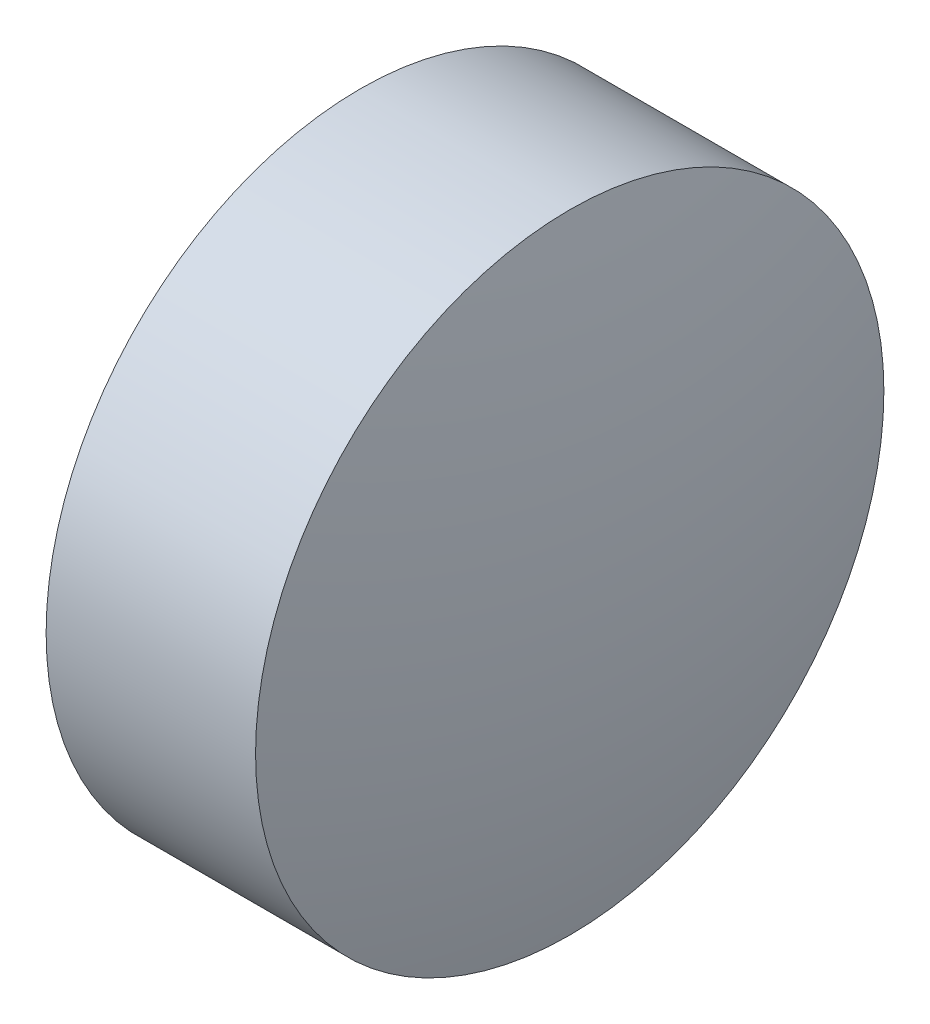
ISO-10303-21;
HEADER;
FILE_DESCRIPTION(('STEP AP214'),'2;1');
FILE_NAME('part.step','',(''),(''),'','','');
FILE_SCHEMA(('AUTOMOTIVE_DESIGN { 1 0 10303 214 1 1 1 1 }'));
ENDSEC;
DATA;
#1=APPLICATION_CONTEXT('core data for automotive mechanical design processes');
#2=APPLICATION_PROTOCOL_DEFINITION('international standard','automotive_design',2000,#1);
#3=PRODUCT_CONTEXT('',#1,'mechanical');
#4=PRODUCT('Part','Part','',(#3));
#5=PRODUCT_RELATED_PRODUCT_CATEGORY('part','',(#4));
#6=PRODUCT_DEFINITION_FORMATION('','',#4);
#7=PRODUCT_DEFINITION_CONTEXT('part definition',#1,'design');
#8=PRODUCT_DEFINITION('design','',#6,#7);
#9=PRODUCT_DEFINITION_SHAPE('','',#8);
#10=(LENGTH_UNIT() NAMED_UNIT(*) SI_UNIT(.MILLI.,.METRE.));
#11=(NAMED_UNIT(*) PLANE_ANGLE_UNIT() SI_UNIT($,.RADIAN.));
#12=(NAMED_UNIT(*) SI_UNIT($,.STERADIAN.) SOLID_ANGLE_UNIT());
#13=UNCERTAINTY_MEASURE_WITH_UNIT(LENGTH_MEASURE(1.E-05),#10,'distance_accuracy_value','');
#14=(GEOMETRIC_REPRESENTATION_CONTEXT(3) GLOBAL_UNCERTAINTY_ASSIGNED_CONTEXT((#13)) GLOBAL_UNIT_ASSIGNED_CONTEXT((#10,
#11,#12)) REPRESENTATION_CONTEXT('',''));
#15=CARTESIAN_POINT('',(0.,0.,0.));
#16=DIRECTION('',(0.,0.,1.));
#17=DIRECTION('',(1.,0.,0.));
#18=AXIS2_PLACEMENT_3D('',#15,#16,#17);
#19=CARTESIAN_POINT('',(15.8750139295614,5.74209340525186,0.));
#20=DIRECTION('',(-1.,0.,0.));
#21=DIRECTION('',(0.,1.,0.));
#22=AXIS2_PLACEMENT_3D('',#19,#20,#21);
#23=SPHERICAL_SURFACE('',#22,6.34326462964457);
#24=CARTESIAN_POINT('',(9.71165604224102,5.74209340525186,0.));
#25=DIRECTION('',(-1.,0.,0.));
#26=DIRECTION('',(0.,-1.,0.));
#27=AXIS2_PLACEMENT_3D('',#24,#25,#26);
#28=CIRCLE('',#27,1.50000857147755);
#29=CARTESIAN_POINT('',(9.71165604224102,4.24208483377431,0.));
#30=VERTEX_POINT('',#29);
#31=EDGE_CURVE('E41',#30,#30,#28,.T.);
#32=ORIENTED_EDGE('',*,*,#31,.T.);
#33=EDGE_LOOP('',(#32));
#34=FACE_BOUND('',#33,.T.);
#35=ADVANCED_FACE('F35',(#34),#23,.T.);
#36=CARTESIAN_POINT('',(4.54829815492087,5.74209340525187,0.));
#37=DIRECTION('',(-1.,0.,0.));
#38=DIRECTION('',(0.,1.,0.));
#39=AXIS2_PLACEMENT_3D('',#36,#37,#38);
#40=SPHERICAL_SURFACE('',#39,6.3432646296444);
#41=CARTESIAN_POINT('',(10.711656042241,5.74209340525186,0.));
#42=DIRECTION('',(-1.,0.,0.));
#43=DIRECTION('',(0.,-1.,0.));
#44=AXIS2_PLACEMENT_3D('',#41,#42,#43);
#45=CIRCLE('',#44,1.50000857147756);
#46=CARTESIAN_POINT('',(10.711656042241,4.2420848337743,0.));
#47=VERTEX_POINT('',#46);
#48=EDGE_CURVE('E10',#47,#47,#45,.T.);
#49=ORIENTED_EDGE('',*,*,#48,.F.);
#50=EDGE_LOOP('',(#49));
#51=FACE_BOUND('',#50,.T.);
#52=ADVANCED_FACE('F50',(#51),#40,.T.);
#53=CARTESIAN_POINT('',(9.28760335599281,5.74209340525186,0.));
#54=DIRECTION('',(-1.,0.,0.));
#55=DIRECTION('',(0.,-1.,0.));
#56=AXIS2_PLACEMENT_3D('',#53,#54,#55);
#57=CYLINDRICAL_SURFACE('',#56,1.50000857147756);
#58=ORIENTED_EDGE('',*,*,#48,.T.);
#59=EDGE_LOOP('',(#58));
#60=FACE_BOUND('',#59,.T.);
#61=ORIENTED_EDGE('',*,*,#31,.F.);
#62=EDGE_LOOP('',(#61));
#63=FACE_BOUND('',#62,.T.);
#64=ADVANCED_FACE('F48',(#60,#63),#57,.T.);
#65=CLOSED_SHELL('',(#35,#52,#64));
#66=MANIFOLD_SOLID_BREP('B2',#65);
#67=ADVANCED_BREP_SHAPE_REPRESENTATION('',(#18,#66),#14);
#68=SHAPE_DEFINITION_REPRESENTATION(#9,#67);
ENDSEC;
END-ISO-10303-21;
